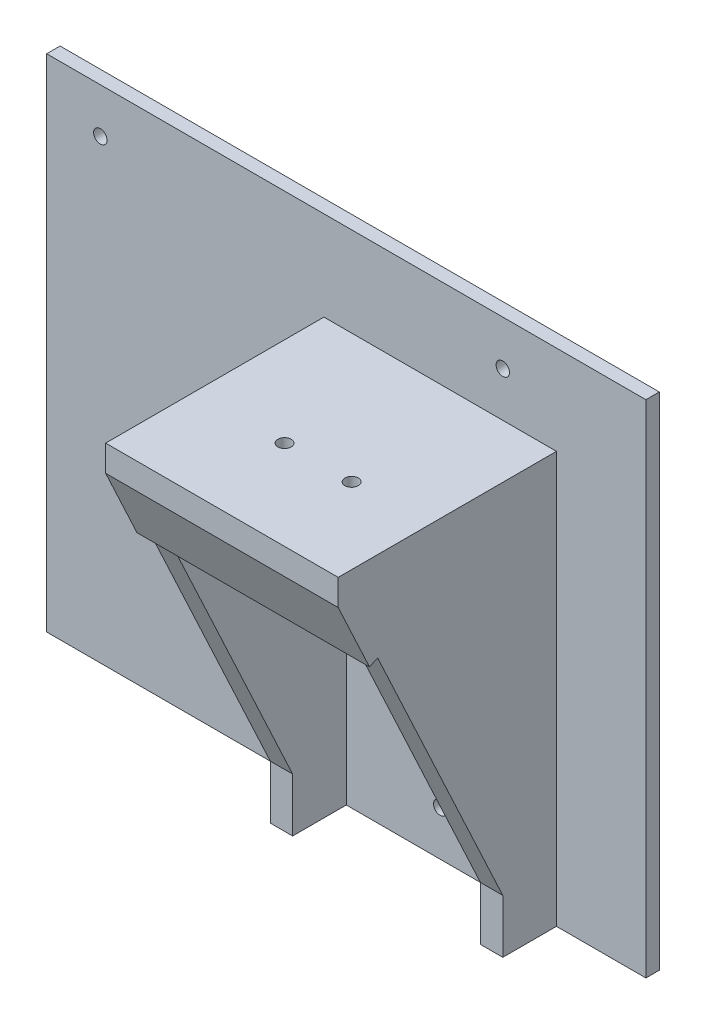
ISO-10303-21;
HEADER;
FILE_DESCRIPTION(('STEP AP214'),'2;1');
FILE_NAME('part.step','',(''),(''),'','','');
FILE_SCHEMA(('AUTOMOTIVE_DESIGN { 1 0 10303 214 1 1 1 1 }'));
ENDSEC;
DATA;
#1=APPLICATION_CONTEXT('core data for automotive mechanical design processes');
#2=APPLICATION_PROTOCOL_DEFINITION('international standard','automotive_design',2000,#1);
#3=PRODUCT_CONTEXT('',#1,'mechanical');
#4=PRODUCT('Part','Part','',(#3));
#5=PRODUCT_RELATED_PRODUCT_CATEGORY('part','',(#4));
#6=PRODUCT_DEFINITION_FORMATION('','',#4);
#7=PRODUCT_DEFINITION_CONTEXT('part definition',#1,'design');
#8=PRODUCT_DEFINITION('design','',#6,#7);
#9=PRODUCT_DEFINITION_SHAPE('','',#8);
#10=(LENGTH_UNIT() NAMED_UNIT(*) SI_UNIT(.MILLI.,.METRE.));
#11=(NAMED_UNIT(*) PLANE_ANGLE_UNIT() SI_UNIT($,.RADIAN.));
#12=(NAMED_UNIT(*) SI_UNIT($,.STERADIAN.) SOLID_ANGLE_UNIT());
#13=UNCERTAINTY_MEASURE_WITH_UNIT(LENGTH_MEASURE(1.E-05),#10,'distance_accuracy_value','');
#14=(GEOMETRIC_REPRESENTATION_CONTEXT(3) GLOBAL_UNCERTAINTY_ASSIGNED_CONTEXT((#13)) GLOBAL_UNIT_ASSIGNED_CONTEXT((#10,
#11,#12)) REPRESENTATION_CONTEXT('',''));
#15=CARTESIAN_POINT('',(0.,0.,0.));
#16=DIRECTION('',(0.,0.,1.));
#17=DIRECTION('',(1.,0.,0.));
#18=AXIS2_PLACEMENT_3D('',#15,#16,#17);
#19=CARTESIAN_POINT('',(36.,-46.,3.));
#20=DIRECTION('',(-1.,0.,0.));
#21=DIRECTION('',(0.,-1.,0.));
#22=AXIS2_PLACEMENT_3D('',#19,#20,#21);
#23=PLANE('',#22);
#24=DIRECTION('',(0.,-1.,0.));
#25=VECTOR('',#24,1.);
#26=CARTESIAN_POINT('',(36.,-46.,3.));
#27=LINE('',#26,#25);
#28=CARTESIAN_POINT('',(36.,46.,3.));
#29=VERTEX_POINT('',#28);
#30=CARTESIAN_POINT('',(36.,-46.,3.));
#31=VERTEX_POINT('',#30);
#32=EDGE_CURVE('E11',#29,#31,#27,.T.);
#33=ORIENTED_EDGE('',*,*,#32,.F.);
#34=DIRECTION('',(0.,0.,-1.));
#35=VECTOR('',#34,1.);
#36=CARTESIAN_POINT('',(36.,46.,3.));
#37=LINE('',#36,#35);
#38=CARTESIAN_POINT('',(36.,46.,51.8123662799905));
#39=VERTEX_POINT('',#38);
#40=EDGE_CURVE('E318',#39,#29,#37,.T.);
#41=ORIENTED_EDGE('',*,*,#40,.F.);
#42=DIRECTION('',(0.,1.,0.));
#43=VECTOR('',#42,1.);
#44=CARTESIAN_POINT('',(36.,0.,51.8123662799905));
#45=LINE('',#44,#43);
#46=CARTESIAN_POINT('',(36.,40.1542290693378,51.8123662799905));
#47=VERTEX_POINT('',#46);
#48=EDGE_CURVE('E242',#47,#39,#45,.T.);
#49=ORIENTED_EDGE('',*,*,#48,.F.);
#50=DIRECTION('',(0.,0.906183139995265,0.422885465331124));
#51=VECTOR('',#50,1.);
#52=CARTESIAN_POINT('',(36.,40.1542290693378,51.8123662799905));
#53=LINE('',#52,#51);
#54=CARTESIAN_POINT('',(36.,25.1542290693377,44.8123662799905));
#55=VERTEX_POINT('',#54);
#56=EDGE_CURVE('E253',#55,#47,#53,.T.);
#57=ORIENTED_EDGE('',*,*,#56,.F.);
#58=DIRECTION('',(0.,0.422885465331124,-0.906183139995265));
#59=VECTOR('',#58,1.);
#60=CARTESIAN_POINT('',(36.,25.1542290693377,44.8123662799905));
#61=LINE('',#60,#59);
#62=CARTESIAN_POINT('',(36.,26.,43.));
#63=VERTEX_POINT('',#62);
#64=EDGE_CURVE('E259',#55,#63,#61,.T.);
#65=ORIENTED_EDGE('',*,*,#64,.T.);
#66=DIRECTION('',(0.,0.906183139995265,0.422885465331124));
#67=VECTOR('',#66,1.);
#68=CARTESIAN_POINT('',(36.,-11.8284671532847,25.3467153284672));
#69=LINE('',#68,#67);
#70=CARTESIAN_POINT('',(36.,-34.,15.));
#71=VERTEX_POINT('',#70);
#72=EDGE_CURVE('E58',#71,#63,#69,.T.);
#73=ORIENTED_EDGE('',*,*,#72,.F.);
#74=DIRECTION('',(0.,1.,0.));
#75=VECTOR('',#74,1.);
#76=CARTESIAN_POINT('',(36.,0.,15.));
#77=LINE('',#76,#75);
#78=CARTESIAN_POINT('',(36.,-46.,15.));
#79=VERTEX_POINT('',#78);
#80=EDGE_CURVE('E292',#79,#71,#77,.T.);
#81=ORIENTED_EDGE('',*,*,#80,.F.);
#82=DIRECTION('',(0.,0.,-1.));
#83=VECTOR('',#82,1.);
#84=CARTESIAN_POINT('',(36.,-46.,3.));
#85=LINE('',#84,#83);
#86=EDGE_CURVE('E315',#79,#31,#85,.T.);
#87=ORIENTED_EDGE('',*,*,#86,.T.);
#88=EDGE_LOOP('',(#33,#41,#49,#57,#65,#73,#81,#87));
#89=FACE_BOUND('',#88,.T.);
#90=ADVANCED_FACE('F34',(#89),#23,.F.);
#91=CARTESIAN_POINT('',(-36.,46.,3.));
#92=DIRECTION('',(0.,-1.,0.));
#93=DIRECTION('',(0.,0.,-1.));
#94=AXIS2_PLACEMENT_3D('',#91,#92,#93);
#95=PLANE('',#94);
#96=CARTESIAN_POINT('',(19.,46.,31.8123662799905));
#97=DIRECTION('',(0.,1.,0.));
#98=DIRECTION('',(0.,0.,1.));
#99=AXIS2_PLACEMENT_3D('',#96,#97,#98);
#100=CIRCLE('',#99,1.5);
#101=CARTESIAN_POINT('',(19.,46.,33.3123662799905));
#102=VERTEX_POINT('',#101);
#103=EDGE_CURVE('E220',#102,#102,#100,.T.);
#104=ORIENTED_EDGE('',*,*,#103,.F.);
#105=EDGE_LOOP('',(#104));
#106=FACE_BOUND('',#105,.T.);
#107=CARTESIAN_POINT('',(3.99999999999998,46.,31.8123662799905));
#108=DIRECTION('',(0.,1.,0.));
#109=DIRECTION('',(0.,0.,1.));
#110=AXIS2_PLACEMENT_3D('',#107,#108,#109);
#111=CIRCLE('',#110,1.5);
#112=CARTESIAN_POINT('',(3.99999999999998,46.,33.3123662799905));
#113=VERTEX_POINT('',#112);
#114=EDGE_CURVE('E213',#113,#113,#111,.T.);
#115=ORIENTED_EDGE('',*,*,#114,.F.);
#116=EDGE_LOOP('',(#115));
#117=FACE_BOUND('',#116,.T.);
#118=DIRECTION('',(1.,0.,0.));
#119=VECTOR('',#118,1.);
#120=CARTESIAN_POINT('',(36.,46.,3.));
#121=LINE('',#120,#119);
#122=CARTESIAN_POINT('',(-16.,46.,3.));
#123=VERTEX_POINT('',#122);
#124=EDGE_CURVE('E42',#123,#29,#121,.T.);
#125=ORIENTED_EDGE('',*,*,#124,.F.);
#126=DIRECTION('',(0.,0.,-1.));
#127=VECTOR('',#126,1.);
#128=CARTESIAN_POINT('',(-16.,46.,50.));
#129=LINE('',#128,#127);
#130=CARTESIAN_POINT('',(-16.,46.,51.8123662799905));
#131=VERTEX_POINT('',#130);
#132=EDGE_CURVE('E304',#131,#123,#129,.T.);
#133=ORIENTED_EDGE('',*,*,#132,.F.);
#134=DIRECTION('',(-1.,0.,0.));
#135=VECTOR('',#134,1.);
#136=CARTESIAN_POINT('',(0.,46.,51.8123662799905));
#137=LINE('',#136,#135);
#138=EDGE_CURVE('E245',#39,#131,#137,.T.);
#139=ORIENTED_EDGE('',*,*,#138,.F.);
#140=ORIENTED_EDGE('',*,*,#40,.T.);
#141=EDGE_LOOP('',(#125,#133,#139,#140));
#142=FACE_BOUND('',#141,.T.);
#143=ADVANCED_FACE('F372',(#106,#117,#142),#95,.F.);
#144=CARTESIAN_POINT('',(36.001,-11.8284671532847,25.3467153284672));
#145=DIRECTION('',(0.,0.422885465331124,-0.906183139995265));
#146=DIRECTION('',(0.,0.906183139995265,0.422885465331124));
#147=AXIS2_PLACEMENT_3D('',#144,#145,#146);
#148=PLANE('',#147);
#149=DIRECTION('',(1.,0.,0.));
#150=VECTOR('',#149,1.);
#151=CARTESIAN_POINT('',(-16.,26.,43.));
#152=LINE('',#151,#150);
#153=CARTESIAN_POINT('',(-16.,26.,43.));
#154=VERTEX_POINT('',#153);
#155=CARTESIAN_POINT('',(-11.,26.,43.));
#156=VERTEX_POINT('',#155);
#157=EDGE_CURVE('E50',#154,#156,#152,.T.);
#158=ORIENTED_EDGE('',*,*,#157,.F.);
#159=DIRECTION('',(0.,-0.906183139995265,-0.422885465331124));
#160=VECTOR('',#159,1.);
#161=CARTESIAN_POINT('',(-16.,-11.8284671532847,25.3467153284672));
#162=LINE('',#161,#160);
#163=CARTESIAN_POINT('',(-16.,-34.,15.));
#164=VERTEX_POINT('',#163);
#165=EDGE_CURVE('E275',#154,#164,#162,.T.);
#166=ORIENTED_EDGE('',*,*,#165,.T.);
#167=DIRECTION('',(-1.,0.,0.));
#168=VECTOR('',#167,1.);
#169=CARTESIAN_POINT('',(36.001,-34.,15.));
#170=LINE('',#169,#168);
#171=CARTESIAN_POINT('',(-11.,-34.,15.));
#172=VERTEX_POINT('',#171);
#173=EDGE_CURVE('E279',#172,#164,#170,.T.);
#174=ORIENTED_EDGE('',*,*,#173,.F.);
#175=DIRECTION('',(0.,0.906183139995265,0.422885465331124));
#176=VECTOR('',#175,1.);
#177=CARTESIAN_POINT('',(-11.,-11.8284671532847,25.3467153284672));
#178=LINE('',#177,#176);
#179=EDGE_CURVE('E266',#172,#156,#178,.T.);
#180=ORIENTED_EDGE('',*,*,#179,.T.);
#181=EDGE_LOOP('',(#158,#166,#174,#180));
#182=FACE_BOUND('',#181,.T.);
#183=ADVANCED_FACE('F340',(#182),#148,.F.);
#184=DIRECTION('',(1.,0.,0.));
#185=VECTOR('',#184,1.);
#186=CARTESIAN_POINT('',(36.001,26.,43.));
#187=LINE('',#186,#185);
#188=CARTESIAN_POINT('',(31.,26.,43.));
#189=VERTEX_POINT('',#188);
#190=EDGE_CURVE('E37',#189,#63,#187,.T.);
#191=ORIENTED_EDGE('',*,*,#190,.F.);
#192=DIRECTION('',(0.,-0.906183139995265,-0.422885465331124));
#193=VECTOR('',#192,1.);
#194=CARTESIAN_POINT('',(31.,-11.8284671532847,25.3467153284672));
#195=LINE('',#194,#193);
#196=CARTESIAN_POINT('',(31.,-34.,15.));
#197=VERTEX_POINT('',#196);
#198=EDGE_CURVE('E268',#189,#197,#195,.T.);
#199=ORIENTED_EDGE('',*,*,#198,.T.);
#200=EDGE_CURVE('E284',#71,#197,#170,.T.);
#201=ORIENTED_EDGE('',*,*,#200,.F.);
#202=ORIENTED_EDGE('',*,*,#72,.T.);
#203=EDGE_LOOP('',(#191,#199,#201,#202));
#204=FACE_BOUND('',#203,.T.);
#205=ADVANCED_FACE('F357',(#204),#148,.F.);
#206=CARTESIAN_POINT('',(0.,0.,3.));
#207=DIRECTION('',(0.,0.,-1.));
#208=DIRECTION('',(-1.,0.,0.));
#209=AXIS2_PLACEMENT_3D('',#206,#207,#208);
#210=PLANE('',#209);
#211=CARTESIAN_POINT('',(9.99999999999998,-36.,3.));
#212=DIRECTION('',(0.,0.,1.));
#213=DIRECTION('',(1.,0.,0.));
#214=AXIS2_PLACEMENT_3D('',#211,#212,#213);
#215=CIRCLE('',#214,1.5);
#216=CARTESIAN_POINT('',(11.5,-36.,3.));
#217=VERTEX_POINT('',#216);
#218=EDGE_CURVE('E424',#217,#217,#215,.T.);
#219=ORIENTED_EDGE('',*,*,#218,.F.);
#220=EDGE_LOOP('',(#219));
#221=FACE_BOUND('',#220,.T.);
#222=DIRECTION('',(0.,-1.,0.));
#223=VECTOR('',#222,1.);
#224=CARTESIAN_POINT('',(31.,-46.,3.));
#225=LINE('',#224,#223);
#226=CARTESIAN_POINT('',(31.,43.,3.));
#227=VERTEX_POINT('',#226);
#228=CARTESIAN_POINT('',(31.,-46.,3.));
#229=VERTEX_POINT('',#228);
#230=EDGE_CURVE('E307',#227,#229,#225,.T.);
#231=ORIENTED_EDGE('',*,*,#230,.F.);
#232=DIRECTION('',(1.,0.,0.));
#233=VECTOR('',#232,1.);
#234=CARTESIAN_POINT('',(-11.,43.,3.));
#235=LINE('',#234,#233);
#236=CARTESIAN_POINT('',(-11.,43.,3.));
#237=VERTEX_POINT('',#236);
#238=EDGE_CURVE('E233',#237,#227,#235,.T.);
#239=ORIENTED_EDGE('',*,*,#238,.F.);
#240=DIRECTION('',(0.,1.,0.));
#241=VECTOR('',#240,1.);
#242=CARTESIAN_POINT('',(-11.,-46.,3.));
#243=LINE('',#242,#241);
#244=CARTESIAN_POINT('',(-11.,-46.,3.));
#245=VERTEX_POINT('',#244);
#246=EDGE_CURVE('E295',#245,#237,#243,.T.);
#247=ORIENTED_EDGE('',*,*,#246,.F.);
#248=DIRECTION('',(1.,0.,0.));
#249=VECTOR('',#248,1.);
#250=CARTESIAN_POINT('',(-36.,-46.,3.));
#251=LINE('',#250,#249);
#252=EDGE_CURVE('E316',#245,#229,#251,.T.);
#253=ORIENTED_EDGE('',*,*,#252,.T.);
#254=EDGE_LOOP('',(#231,#239,#247,#253));
#255=FACE_BOUND('',#254,.T.);
#256=ADVANCED_FACE('F380',(#221,#255),#210,.F.);
#257=CARTESIAN_POINT('',(24.,56.,3.));
#258=DIRECTION('',(0.,0.,1.));
#259=DIRECTION('',(1.,0.,0.));
#260=AXIS2_PLACEMENT_3D('',#257,#258,#259);
#261=CIRCLE('',#260,1.5);
#262=CARTESIAN_POINT('',(25.5,56.,3.));
#263=VERTEX_POINT('',#262);
#264=EDGE_CURVE('E188',#263,#263,#261,.T.);
#265=ORIENTED_EDGE('',*,*,#264,.F.);
#266=EDGE_LOOP('',(#265));
#267=FACE_BOUND('',#266,.T.);
#268=CARTESIAN_POINT('',(-66.,56.,3.));
#269=DIRECTION('',(0.,0.,1.));
#270=DIRECTION('',(1.,0.,0.));
#271=AXIS2_PLACEMENT_3D('',#268,#269,#270);
#272=CIRCLE('',#271,1.5);
#273=CARTESIAN_POINT('',(-64.5,56.,3.));
#274=VERTEX_POINT('',#273);
#275=EDGE_CURVE('E420',#274,#274,#272,.T.);
#276=ORIENTED_EDGE('',*,*,#275,.F.);
#277=EDGE_LOOP('',(#276));
#278=FACE_BOUND('',#277,.T.);
#279=DIRECTION('',(0.,-1.,0.));
#280=VECTOR('',#279,1.);
#281=CARTESIAN_POINT('',(-16.,-46.,3.));
#282=LINE('',#281,#280);
#283=CARTESIAN_POINT('',(-16.,-46.,3.));
#284=VERTEX_POINT('',#283);
#285=EDGE_CURVE('E297',#123,#284,#282,.T.);
#286=ORIENTED_EDGE('',*,*,#285,.F.);
#287=ORIENTED_EDGE('',*,*,#124,.T.);
#288=ORIENTED_EDGE('',*,*,#32,.T.);
#289=DIRECTION('',(-1.,0.,0.));
#290=VECTOR('',#289,1.);
#291=CARTESIAN_POINT('',(56.,-46.,3.));
#292=LINE('',#291,#290);
#293=CARTESIAN_POINT('',(56.,-46.,3.));
#294=VERTEX_POINT('',#293);
#295=EDGE_CURVE('E173',#294,#31,#292,.T.);
#296=ORIENTED_EDGE('',*,*,#295,.F.);
#297=DIRECTION('',(0.,-1.,0.));
#298=VECTOR('',#297,1.);
#299=CARTESIAN_POINT('',(56.,-46.,3.));
#300=LINE('',#299,#298);
#301=CARTESIAN_POINT('',(56.,66.,3.));
#302=VERTEX_POINT('',#301);
#303=EDGE_CURVE('E202',#302,#294,#300,.T.);
#304=ORIENTED_EDGE('',*,*,#303,.F.);
#305=DIRECTION('',(1.,0.,0.));
#306=VECTOR('',#305,1.);
#307=CARTESIAN_POINT('',(36.,66.,3.));
#308=LINE('',#307,#306);
#309=CARTESIAN_POINT('',(-78.,66.,3.));
#310=VERTEX_POINT('',#309);
#311=EDGE_CURVE('E172',#310,#302,#308,.T.);
#312=ORIENTED_EDGE('',*,*,#311,.F.);
#313=DIRECTION('',(0.,1.,0.));
#314=VECTOR('',#313,1.);
#315=CARTESIAN_POINT('',(-78.,-46.,3.));
#316=LINE('',#315,#314);
#317=CARTESIAN_POINT('',(-78.,-46.,3.));
#318=VERTEX_POINT('',#317);
#319=EDGE_CURVE('E187',#318,#310,#316,.T.);
#320=ORIENTED_EDGE('',*,*,#319,.F.);
#321=EDGE_CURVE('E312',#318,#284,#251,.T.);
#322=ORIENTED_EDGE('',*,*,#321,.T.);
#323=EDGE_LOOP('',(#286,#287,#288,#296,#304,#312,#320,#322));
#324=FACE_BOUND('',#323,.T.);
#325=ADVANCED_FACE('F369',(#267,#278,#324),#210,.F.);
#326=CARTESIAN_POINT('',(-36.,-46.,3.));
#327=DIRECTION('',(0.,1.,0.));
#328=DIRECTION('',(0.,0.,1.));
#329=AXIS2_PLACEMENT_3D('',#326,#327,#328);
#330=PLANE('',#329);
#331=ORIENTED_EDGE('',*,*,#86,.F.);
#332=DIRECTION('',(-1.,0.,0.));
#333=VECTOR('',#332,1.);
#334=CARTESIAN_POINT('',(36.001,-46.,15.));
#335=LINE('',#334,#333);
#336=CARTESIAN_POINT('',(31.,-46.,15.));
#337=VERTEX_POINT('',#336);
#338=EDGE_CURVE('E283',#79,#337,#335,.T.);
#339=ORIENTED_EDGE('',*,*,#338,.T.);
#340=DIRECTION('',(0.,0.,-1.));
#341=VECTOR('',#340,1.);
#342=CARTESIAN_POINT('',(31.,-46.,50.));
#343=LINE('',#342,#341);
#344=EDGE_CURVE('E310',#337,#229,#343,.T.);
#345=ORIENTED_EDGE('',*,*,#344,.T.);
#346=ORIENTED_EDGE('',*,*,#252,.F.);
#347=DIRECTION('',(0.,0.,-1.));
#348=VECTOR('',#347,1.);
#349=CARTESIAN_POINT('',(-11.,-46.,50.));
#350=LINE('',#349,#348);
#351=CARTESIAN_POINT('',(-11.,-46.,15.));
#352=VERTEX_POINT('',#351);
#353=EDGE_CURVE('E300',#352,#245,#350,.T.);
#354=ORIENTED_EDGE('',*,*,#353,.F.);
#355=CARTESIAN_POINT('',(-16.,-46.,15.));
#356=VERTEX_POINT('',#355);
#357=EDGE_CURVE('E280',#352,#356,#335,.T.);
#358=ORIENTED_EDGE('',*,*,#357,.T.);
#359=DIRECTION('',(0.,0.,-1.));
#360=VECTOR('',#359,1.);
#361=CARTESIAN_POINT('',(-16.,-46.,50.));
#362=LINE('',#361,#360);
#363=EDGE_CURVE('E302',#356,#284,#362,.T.);
#364=ORIENTED_EDGE('',*,*,#363,.T.);
#365=ORIENTED_EDGE('',*,*,#321,.F.);
#366=DIRECTION('',(0.,0.,1.));
#367=VECTOR('',#366,1.);
#368=CARTESIAN_POINT('',(-78.,-46.,0.));
#369=LINE('',#368,#367);
#370=CARTESIAN_POINT('',(-78.,-46.,0.));
#371=VERTEX_POINT('',#370);
#372=EDGE_CURVE('E182',#371,#318,#369,.T.);
#373=ORIENTED_EDGE('',*,*,#372,.F.);
#374=DIRECTION('',(1.,0.,0.));
#375=VECTOR('',#374,1.);
#376=CARTESIAN_POINT('',(-36.,-46.,0.));
#377=LINE('',#376,#375);
#378=CARTESIAN_POINT('',(56.,-46.,0.));
#379=VERTEX_POINT('',#378);
#380=EDGE_CURVE('E178',#371,#379,#377,.T.);
#381=ORIENTED_EDGE('',*,*,#380,.T.);
#382=DIRECTION('',(0.,0.,-1.));
#383=VECTOR('',#382,1.);
#384=CARTESIAN_POINT('',(56.,-46.,0.));
#385=LINE('',#384,#383);
#386=EDGE_CURVE('E204',#294,#379,#385,.T.);
#387=ORIENTED_EDGE('',*,*,#386,.F.);
#388=ORIENTED_EDGE('',*,*,#295,.T.);
#389=EDGE_LOOP('',(#331,#339,#345,#346,#354,#358,#364,#365,#373,#381,#387,#388));
#390=FACE_BOUND('',#389,.T.);
#391=ADVANCED_FACE('F363',(#390),#330,.F.);
#392=CARTESIAN_POINT('',(0.,0.,0.));
#393=DIRECTION('',(0.,0.,-1.));
#394=DIRECTION('',(-1.,0.,0.));
#395=AXIS2_PLACEMENT_3D('',#392,#393,#394);
#396=PLANE('',#395);
#397=CARTESIAN_POINT('',(24.,56.,0.));
#398=DIRECTION('',(0.,0.,-1.));
#399=DIRECTION('',(-1.,0.,0.));
#400=AXIS2_PLACEMENT_3D('',#397,#398,#399);
#401=CIRCLE('',#400,1.5);
#402=CARTESIAN_POINT('',(22.5,56.,0.));
#403=VERTEX_POINT('',#402);
#404=EDGE_CURVE('E191',#403,#403,#401,.F.);
#405=ORIENTED_EDGE('',*,*,#404,.T.);
#406=EDGE_LOOP('',(#405));
#407=FACE_BOUND('',#406,.T.);
#408=CARTESIAN_POINT('',(9.99999999999998,-36.,0.));
#409=DIRECTION('',(0.,0.,-1.));
#410=DIRECTION('',(-1.,0.,0.));
#411=AXIS2_PLACEMENT_3D('',#408,#409,#410);
#412=CIRCLE('',#411,1.5);
#413=CARTESIAN_POINT('',(8.49999999999998,-36.,0.));
#414=VERTEX_POINT('',#413);
#415=EDGE_CURVE('E416',#414,#414,#412,.F.);
#416=ORIENTED_EDGE('',*,*,#415,.T.);
#417=EDGE_LOOP('',(#416));
#418=FACE_BOUND('',#417,.T.);
#419=CARTESIAN_POINT('',(-66.,56.,0.));
#420=DIRECTION('',(0.,0.,-1.));
#421=DIRECTION('',(-1.,0.,0.));
#422=AXIS2_PLACEMENT_3D('',#419,#420,#421);
#423=CIRCLE('',#422,1.5);
#424=CARTESIAN_POINT('',(-67.5,56.,0.));
#425=VERTEX_POINT('',#424);
#426=EDGE_CURVE('E194',#425,#425,#423,.F.);
#427=ORIENTED_EDGE('',*,*,#426,.T.);
#428=EDGE_LOOP('',(#427));
#429=FACE_BOUND('',#428,.T.);
#430=DIRECTION('',(-1.,0.,0.));
#431=VECTOR('',#430,1.);
#432=CARTESIAN_POINT('',(36.,66.,0.));
#433=LINE('',#432,#431);
#434=CARTESIAN_POINT('',(56.,66.,0.));
#435=VERTEX_POINT('',#434);
#436=CARTESIAN_POINT('',(-78.,66.,0.));
#437=VERTEX_POINT('',#436);
#438=EDGE_CURVE('E162',#435,#437,#433,.T.);
#439=ORIENTED_EDGE('',*,*,#438,.F.);
#440=DIRECTION('',(0.,1.,0.));
#441=VECTOR('',#440,1.);
#442=CARTESIAN_POINT('',(56.,-46.,0.));
#443=LINE('',#442,#441);
#444=EDGE_CURVE('E199',#379,#435,#443,.T.);
#445=ORIENTED_EDGE('',*,*,#444,.F.);
#446=ORIENTED_EDGE('',*,*,#380,.F.);
#447=DIRECTION('',(0.,-1.,0.));
#448=VECTOR('',#447,1.);
#449=CARTESIAN_POINT('',(-78.,66.,0.));
#450=LINE('',#449,#448);
#451=EDGE_CURVE('E176',#437,#371,#450,.T.);
#452=ORIENTED_EDGE('',*,*,#451,.F.);
#453=EDGE_LOOP('',(#439,#445,#446,#452));
#454=FACE_BOUND('',#453,.T.);
#455=ADVANCED_FACE('F177',(#407,#418,#429,#454),#396,.T.);
#456=CARTESIAN_POINT('',(31.,-46.,50.));
#457=DIRECTION('',(1.,0.,0.));
#458=DIRECTION('',(0.,0.,-1.));
#459=AXIS2_PLACEMENT_3D('',#456,#457,#458);
#460=PLANE('',#459);
#461=DIRECTION('',(0.,-1.,0.));
#462=VECTOR('',#461,1.);
#463=CARTESIAN_POINT('',(31.,0.,15.));
#464=LINE('',#463,#462);
#465=EDGE_CURVE('E290',#197,#337,#464,.T.);
#466=ORIENTED_EDGE('',*,*,#465,.F.);
#467=ORIENTED_EDGE('',*,*,#198,.F.);
#468=DIRECTION('',(0.,-1.,0.));
#469=VECTOR('',#468,1.);
#470=CARTESIAN_POINT('',(31.,43.,43.));
#471=LINE('',#470,#469);
#472=CARTESIAN_POINT('',(31.,43.,43.));
#473=VERTEX_POINT('',#472);
#474=EDGE_CURVE('E236',#473,#189,#471,.T.);
#475=ORIENTED_EDGE('',*,*,#474,.F.);
#476=DIRECTION('',(0.,0.,1.));
#477=VECTOR('',#476,1.);
#478=CARTESIAN_POINT('',(31.,43.,3.));
#479=LINE('',#478,#477);
#480=EDGE_CURVE('E216',#227,#473,#479,.T.);
#481=ORIENTED_EDGE('',*,*,#480,.F.);
#482=ORIENTED_EDGE('',*,*,#230,.T.);
#483=ORIENTED_EDGE('',*,*,#344,.F.);
#484=EDGE_LOOP('',(#466,#467,#475,#481,#482,#483));
#485=FACE_BOUND('',#484,.T.);
#486=ADVANCED_FACE('F355',(#485),#460,.F.);
#487=CARTESIAN_POINT('',(-11.,-46.,50.));
#488=DIRECTION('',(-1.,0.,0.));
#489=DIRECTION('',(0.,0.,1.));
#490=AXIS2_PLACEMENT_3D('',#487,#488,#489);
#491=PLANE('',#490);
#492=ORIENTED_EDGE('',*,*,#246,.T.);
#493=DIRECTION('',(0.,0.,-1.));
#494=VECTOR('',#493,1.);
#495=CARTESIAN_POINT('',(-11.,43.,43.));
#496=LINE('',#495,#494);
#497=CARTESIAN_POINT('',(-11.,43.,43.));
#498=VERTEX_POINT('',#497);
#499=EDGE_CURVE('E230',#498,#237,#496,.T.);
#500=ORIENTED_EDGE('',*,*,#499,.F.);
#501=DIRECTION('',(0.,-1.,0.));
#502=VECTOR('',#501,1.);
#503=CARTESIAN_POINT('',(-11.,43.,43.));
#504=LINE('',#503,#502);
#505=EDGE_CURVE('E237',#498,#156,#504,.T.);
#506=ORIENTED_EDGE('',*,*,#505,.T.);
#507=ORIENTED_EDGE('',*,*,#179,.F.);
#508=DIRECTION('',(0.,1.,0.));
#509=VECTOR('',#508,1.);
#510=CARTESIAN_POINT('',(-11.,0.,15.));
#511=LINE('',#510,#509);
#512=EDGE_CURVE('E287',#352,#172,#511,.T.);
#513=ORIENTED_EDGE('',*,*,#512,.F.);
#514=ORIENTED_EDGE('',*,*,#353,.T.);
#515=EDGE_LOOP('',(#492,#500,#506,#507,#513,#514));
#516=FACE_BOUND('',#515,.T.);
#517=ADVANCED_FACE('F347',(#516),#491,.F.);
#518=CARTESIAN_POINT('',(-16.,-46.,50.));
#519=DIRECTION('',(1.,0.,0.));
#520=DIRECTION('',(0.,1.,0.));
#521=AXIS2_PLACEMENT_3D('',#518,#519,#520);
#522=PLANE('',#521);
#523=DIRECTION('',(0.,-0.906183139995265,-0.422885465331124));
#524=VECTOR('',#523,1.);
#525=CARTESIAN_POINT('',(-16.,40.1542290693378,51.8123662799905));
#526=LINE('',#525,#524);
#527=CARTESIAN_POINT('',(-16.,40.1542290693378,51.8123662799905));
#528=VERTEX_POINT('',#527);
#529=CARTESIAN_POINT('',(-16.,25.1542290693377,44.8123662799905));
#530=VERTEX_POINT('',#529);
#531=EDGE_CURVE('E248',#528,#530,#526,.T.);
#532=ORIENTED_EDGE('',*,*,#531,.F.);
#533=DIRECTION('',(0.,-1.,0.));
#534=VECTOR('',#533,1.);
#535=CARTESIAN_POINT('',(-16.,0.,51.8123662799905));
#536=LINE('',#535,#534);
#537=EDGE_CURVE('E239',#131,#528,#536,.T.);
#538=ORIENTED_EDGE('',*,*,#537,.F.);
#539=ORIENTED_EDGE('',*,*,#132,.T.);
#540=ORIENTED_EDGE('',*,*,#285,.T.);
#541=ORIENTED_EDGE('',*,*,#363,.F.);
#542=DIRECTION('',(0.,-1.,0.));
#543=VECTOR('',#542,1.);
#544=CARTESIAN_POINT('',(-16.,0.,15.));
#545=LINE('',#544,#543);
#546=EDGE_CURVE('E277',#164,#356,#545,.T.);
#547=ORIENTED_EDGE('',*,*,#546,.F.);
#548=ORIENTED_EDGE('',*,*,#165,.F.);
#549=DIRECTION('',(0.,0.422885465331124,-0.906183139995265));
#550=VECTOR('',#549,1.);
#551=CARTESIAN_POINT('',(-16.,25.1542290693377,44.8123662799905));
#552=LINE('',#551,#550);
#553=EDGE_CURVE('E263',#530,#154,#552,.T.);
#554=ORIENTED_EDGE('',*,*,#553,.F.);
#555=EDGE_LOOP('',(#532,#538,#539,#540,#541,#547,#548,#554));
#556=FACE_BOUND('',#555,.T.);
#557=ADVANCED_FACE('F336',(#556),#522,.F.);
#558=CARTESIAN_POINT('',(36.001,0.,15.));
#559=DIRECTION('',(0.,0.,-1.));
#560=DIRECTION('',(-1.,0.,0.));
#561=AXIS2_PLACEMENT_3D('',#558,#559,#560);
#562=PLANE('',#561);
#563=ORIENTED_EDGE('',*,*,#80,.T.);
#564=ORIENTED_EDGE('',*,*,#200,.T.);
#565=ORIENTED_EDGE('',*,*,#465,.T.);
#566=ORIENTED_EDGE('',*,*,#338,.F.);
#567=EDGE_LOOP('',(#563,#564,#565,#566));
#568=FACE_BOUND('',#567,.T.);
#569=ADVANCED_FACE('F359',(#568),#562,.F.);
#570=ORIENTED_EDGE('',*,*,#512,.T.);
#571=ORIENTED_EDGE('',*,*,#173,.T.);
#572=ORIENTED_EDGE('',*,*,#546,.T.);
#573=ORIENTED_EDGE('',*,*,#357,.F.);
#574=EDGE_LOOP('',(#570,#571,#572,#573));
#575=FACE_BOUND('',#574,.T.);
#576=ADVANCED_FACE('F342',(#575),#562,.F.);
#577=CARTESIAN_POINT('',(-16.,25.1542290693377,44.8123662799905));
#578=DIRECTION('',(0.,0.906183139995265,0.422885465331124));
#579=DIRECTION('',(0.,-0.422885465331124,0.906183139995265));
#580=AXIS2_PLACEMENT_3D('',#577,#578,#579);
#581=PLANE('',#580);
#582=ORIENTED_EDGE('',*,*,#157,.T.);
#583=DIRECTION('',(-1.,0.,0.));
#584=VECTOR('',#583,1.);
#585=CARTESIAN_POINT('',(36.001,26.,43.));
#586=LINE('',#585,#584);
#587=EDGE_CURVE('E272',#189,#156,#586,.T.);
#588=ORIENTED_EDGE('',*,*,#587,.F.);
#589=ORIENTED_EDGE('',*,*,#190,.T.);
#590=ORIENTED_EDGE('',*,*,#64,.F.);
#591=DIRECTION('',(1.,0.,0.));
#592=VECTOR('',#591,1.);
#593=CARTESIAN_POINT('',(-16.,25.1542290693377,44.8123662799905));
#594=LINE('',#593,#592);
#595=EDGE_CURVE('E251',#530,#55,#594,.T.);
#596=ORIENTED_EDGE('',*,*,#595,.F.);
#597=ORIENTED_EDGE('',*,*,#553,.T.);
#598=EDGE_LOOP('',(#582,#588,#589,#590,#596,#597));
#599=FACE_BOUND('',#598,.T.);
#600=ADVANCED_FACE('F325',(#599),#581,.F.);
#601=CARTESIAN_POINT('',(0.,-12.6742380839469,27.1590816084577));
#602=DIRECTION('',(0.,-0.422885465331124,0.906183139995265));
#603=DIRECTION('',(0.,-0.906183139995265,-0.422885465331124));
#604=AXIS2_PLACEMENT_3D('',#601,#602,#603);
#605=PLANE('',#604);
#606=ORIENTED_EDGE('',*,*,#531,.T.);
#607=ORIENTED_EDGE('',*,*,#595,.T.);
#608=ORIENTED_EDGE('',*,*,#56,.T.);
#609=DIRECTION('',(-1.,0.,0.));
#610=VECTOR('',#609,1.);
#611=CARTESIAN_POINT('',(-16.,40.1542290693378,51.8123662799905));
#612=LINE('',#611,#610);
#613=EDGE_CURVE('E256',#47,#528,#612,.T.);
#614=ORIENTED_EDGE('',*,*,#613,.T.);
#615=EDGE_LOOP('',(#606,#607,#608,#614));
#616=FACE_BOUND('',#615,.T.);
#617=ADVANCED_FACE('F332',(#616),#605,.T.);
#618=CARTESIAN_POINT('',(0.,0.,51.8123662799905));
#619=DIRECTION('',(0.,0.,1.));
#620=DIRECTION('',(1.,0.,0.));
#621=AXIS2_PLACEMENT_3D('',#618,#619,#620);
#622=PLANE('',#621);
#623=ORIENTED_EDGE('',*,*,#537,.T.);
#624=ORIENTED_EDGE('',*,*,#613,.F.);
#625=ORIENTED_EDGE('',*,*,#48,.T.);
#626=ORIENTED_EDGE('',*,*,#138,.T.);
#627=EDGE_LOOP('',(#623,#624,#625,#626));
#628=FACE_BOUND('',#627,.T.);
#629=ADVANCED_FACE('F371',(#628),#622,.T.);
#630=CARTESIAN_POINT('',(31.,43.,43.));
#631=DIRECTION('',(0.,0.,1.));
#632=DIRECTION('',(1.,0.,0.));
#633=AXIS2_PLACEMENT_3D('',#630,#631,#632);
#634=PLANE('',#633);
#635=ORIENTED_EDGE('',*,*,#587,.T.);
#636=ORIENTED_EDGE('',*,*,#505,.F.);
#637=DIRECTION('',(-1.,0.,0.));
#638=VECTOR('',#637,1.);
#639=CARTESIAN_POINT('',(31.,43.,43.));
#640=LINE('',#639,#638);
#641=EDGE_CURVE('E227',#473,#498,#640,.T.);
#642=ORIENTED_EDGE('',*,*,#641,.F.);
#643=ORIENTED_EDGE('',*,*,#474,.T.);
#644=EDGE_LOOP('',(#635,#636,#642,#643));
#645=FACE_BOUND('',#644,.T.);
#646=ADVANCED_FACE('F351',(#645),#634,.F.);
#647=CARTESIAN_POINT('',(0.,43.,0.));
#648=DIRECTION('',(0.,-1.,0.));
#649=DIRECTION('',(1.,0.,0.));
#650=AXIS2_PLACEMENT_3D('',#647,#648,#649);
#651=PLANE('',#650);
#652=CARTESIAN_POINT('',(3.99999999999998,43.,31.8123662799905));
#653=DIRECTION('',(0.,-1.,0.));
#654=DIRECTION('',(1.,0.,0.));
#655=AXIS2_PLACEMENT_3D('',#652,#653,#654);
#656=CIRCLE('',#655,1.5);
#657=CARTESIAN_POINT('',(5.49999999999998,43.,31.8123662799905));
#658=VERTEX_POINT('',#657);
#659=EDGE_CURVE('E217',#658,#658,#656,.F.);
#660=ORIENTED_EDGE('',*,*,#659,.T.);
#661=EDGE_LOOP('',(#660));
#662=FACE_BOUND('',#661,.T.);
#663=CARTESIAN_POINT('',(19.,43.,31.8123662799905));
#664=DIRECTION('',(0.,-1.,0.));
#665=DIRECTION('',(1.,0.,0.));
#666=AXIS2_PLACEMENT_3D('',#663,#664,#665);
#667=CIRCLE('',#666,1.5);
#668=CARTESIAN_POINT('',(20.5,43.,31.8123662799905));
#669=VERTEX_POINT('',#668);
#670=EDGE_CURVE('E210',#669,#669,#667,.F.);
#671=ORIENTED_EDGE('',*,*,#670,.T.);
#672=EDGE_LOOP('',(#671));
#673=FACE_BOUND('',#672,.T.);
#674=ORIENTED_EDGE('',*,*,#480,.T.);
#675=ORIENTED_EDGE('',*,*,#641,.T.);
#676=ORIENTED_EDGE('',*,*,#499,.T.);
#677=ORIENTED_EDGE('',*,*,#238,.T.);
#678=EDGE_LOOP('',(#674,#675,#676,#677));
#679=FACE_BOUND('',#678,.T.);
#680=ADVANCED_FACE('F379',(#662,#673,#679),#651,.T.);
#681=CARTESIAN_POINT('',(19.,-46.001,31.8123662799905));
#682=DIRECTION('',(0.,1.,0.));
#683=DIRECTION('',(0.,0.,1.));
#684=AXIS2_PLACEMENT_3D('',#681,#682,#683);
#685=CYLINDRICAL_SURFACE('',#684,1.5);
#686=ORIENTED_EDGE('',*,*,#670,.F.);
#687=EDGE_LOOP('',(#686));
#688=FACE_BOUND('',#687,.T.);
#689=ORIENTED_EDGE('',*,*,#103,.T.);
#690=EDGE_LOOP('',(#689));
#691=FACE_BOUND('',#690,.T.);
#692=ADVANCED_FACE('F455',(#688,#691),#685,.F.);
#693=CARTESIAN_POINT('',(3.99999999999998,-46.001,31.8123662799905));
#694=DIRECTION('',(0.,1.,0.));
#695=DIRECTION('',(0.,0.,1.));
#696=AXIS2_PLACEMENT_3D('',#693,#694,#695);
#697=CYLINDRICAL_SURFACE('',#696,1.5);
#698=ORIENTED_EDGE('',*,*,#659,.F.);
#699=EDGE_LOOP('',(#698));
#700=FACE_BOUND('',#699,.T.);
#701=ORIENTED_EDGE('',*,*,#114,.T.);
#702=EDGE_LOOP('',(#701));
#703=FACE_BOUND('',#702,.T.);
#704=ADVANCED_FACE('F452',(#700,#703),#697,.F.);
#705=CARTESIAN_POINT('',(0.,66.,0.));
#706=DIRECTION('',(0.,-1.,0.));
#707=DIRECTION('',(0.,0.,-1.));
#708=AXIS2_PLACEMENT_3D('',#705,#706,#707);
#709=PLANE('',#708);
#710=ORIENTED_EDGE('',*,*,#311,.T.);
#711=DIRECTION('',(0.,0.,1.));
#712=VECTOR('',#711,1.);
#713=CARTESIAN_POINT('',(56.,66.,0.));
#714=LINE('',#713,#712);
#715=EDGE_CURVE('E168',#435,#302,#714,.T.);
#716=ORIENTED_EDGE('',*,*,#715,.F.);
#717=ORIENTED_EDGE('',*,*,#438,.T.);
#718=DIRECTION('',(0.,0.,-1.));
#719=VECTOR('',#718,1.);
#720=CARTESIAN_POINT('',(-78.,66.,3.));
#721=LINE('',#720,#719);
#722=EDGE_CURVE('E166',#310,#437,#721,.T.);
#723=ORIENTED_EDGE('',*,*,#722,.F.);
#724=EDGE_LOOP('',(#710,#716,#717,#723));
#725=FACE_BOUND('',#724,.T.);
#726=ADVANCED_FACE('F164',(#725),#709,.F.);
#727=CARTESIAN_POINT('',(56.,0.,0.));
#728=DIRECTION('',(1.,0.,0.));
#729=DIRECTION('',(0.,1.,0.));
#730=AXIS2_PLACEMENT_3D('',#727,#728,#729);
#731=PLANE('',#730);
#732=ORIENTED_EDGE('',*,*,#444,.T.);
#733=ORIENTED_EDGE('',*,*,#715,.T.);
#734=ORIENTED_EDGE('',*,*,#303,.T.);
#735=ORIENTED_EDGE('',*,*,#386,.T.);
#736=EDGE_LOOP('',(#732,#733,#734,#735));
#737=FACE_BOUND('',#736,.T.);
#738=ADVANCED_FACE('F446',(#737),#731,.T.);
#739=CARTESIAN_POINT('',(-78.,0.,0.));
#740=DIRECTION('',(-1.,0.,0.));
#741=DIRECTION('',(0.,-1.,0.));
#742=AXIS2_PLACEMENT_3D('',#739,#740,#741);
#743=PLANE('',#742);
#744=ORIENTED_EDGE('',*,*,#722,.T.);
#745=ORIENTED_EDGE('',*,*,#451,.T.);
#746=ORIENTED_EDGE('',*,*,#372,.T.);
#747=ORIENTED_EDGE('',*,*,#319,.T.);
#748=EDGE_LOOP('',(#744,#745,#746,#747));
#749=FACE_BOUND('',#748,.T.);
#750=ADVANCED_FACE('F185',(#749),#743,.T.);
#751=CARTESIAN_POINT('',(-66.,56.,-0.00100000000000013));
#752=DIRECTION('',(0.,0.,1.));
#753=DIRECTION('',(1.,0.,0.));
#754=AXIS2_PLACEMENT_3D('',#751,#752,#753);
#755=CYLINDRICAL_SURFACE('',#754,1.5);
#756=ORIENTED_EDGE('',*,*,#426,.F.);
#757=EDGE_LOOP('',(#756));
#758=FACE_BOUND('',#757,.T.);
#759=ORIENTED_EDGE('',*,*,#275,.T.);
#760=EDGE_LOOP('',(#759));
#761=FACE_BOUND('',#760,.T.);
#762=ADVANCED_FACE('F433',(#758,#761),#755,.F.);
#763=CARTESIAN_POINT('',(9.99999999999998,-36.,-0.00100000000000013));
#764=DIRECTION('',(0.,0.,1.));
#765=DIRECTION('',(1.,0.,0.));
#766=AXIS2_PLACEMENT_3D('',#763,#764,#765);
#767=CYLINDRICAL_SURFACE('',#766,1.5);
#768=ORIENTED_EDGE('',*,*,#415,.F.);
#769=EDGE_LOOP('',(#768));
#770=FACE_BOUND('',#769,.T.);
#771=ORIENTED_EDGE('',*,*,#218,.T.);
#772=EDGE_LOOP('',(#771));
#773=FACE_BOUND('',#772,.T.);
#774=ADVANCED_FACE('F430',(#770,#773),#767,.F.);
#775=CARTESIAN_POINT('',(24.,56.,-0.00100000000000013));
#776=DIRECTION('',(0.,0.,1.));
#777=DIRECTION('',(1.,0.,0.));
#778=AXIS2_PLACEMENT_3D('',#775,#776,#777);
#779=CYLINDRICAL_SURFACE('',#778,1.5);
#780=ORIENTED_EDGE('',*,*,#404,.F.);
#781=EDGE_LOOP('',(#780));
#782=FACE_BOUND('',#781,.T.);
#783=ORIENTED_EDGE('',*,*,#264,.T.);
#784=EDGE_LOOP('',(#783));
#785=FACE_BOUND('',#784,.T.);
#786=ADVANCED_FACE('F432',(#782,#785),#779,.F.);
#787=CLOSED_SHELL('',(#90,#143,#183,#205,#256,#325,#391,#455,#486,#517,#557,#569,#576,#600,#617,
#629,#646,#680,#692,#704,#726,#738,#750,#762,#774,#786));
#788=MANIFOLD_SOLID_BREP('B2',#787);
#789=ADVANCED_BREP_SHAPE_REPRESENTATION('',(#18,#788),#14);
#790=SHAPE_DEFINITION_REPRESENTATION(#9,#789);
ENDSEC;
END-ISO-10303-21;
